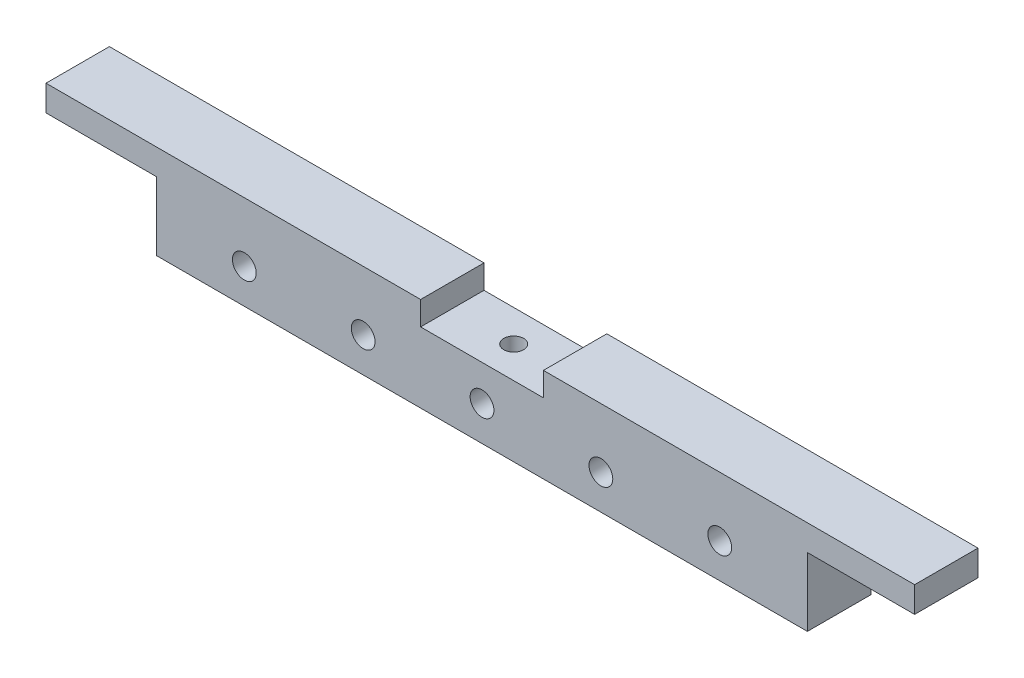
ISO-10303-21;
HEADER;
FILE_DESCRIPTION(('STEP AP214'),'2;1');
FILE_NAME('part.step','',(''),(''),'','','');
FILE_SCHEMA(('AUTOMOTIVE_DESIGN { 1 0 10303 214 1 1 1 1 }'));
ENDSEC;
DATA;
#1=APPLICATION_CONTEXT('core data for automotive mechanical design processes');
#2=APPLICATION_PROTOCOL_DEFINITION('international standard','automotive_design',2000,#1);
#3=PRODUCT_CONTEXT('',#1,'mechanical');
#4=PRODUCT('Part','Part','',(#3));
#5=PRODUCT_RELATED_PRODUCT_CATEGORY('part','',(#4));
#6=PRODUCT_DEFINITION_FORMATION('','',#4);
#7=PRODUCT_DEFINITION_CONTEXT('part definition',#1,'design');
#8=PRODUCT_DEFINITION('design','',#6,#7);
#9=PRODUCT_DEFINITION_SHAPE('','',#8);
#10=(LENGTH_UNIT() NAMED_UNIT(*) SI_UNIT(.MILLI.,.METRE.));
#11=(NAMED_UNIT(*) PLANE_ANGLE_UNIT() SI_UNIT($,.RADIAN.));
#12=(NAMED_UNIT(*) SI_UNIT($,.STERADIAN.) SOLID_ANGLE_UNIT());
#13=UNCERTAINTY_MEASURE_WITH_UNIT(LENGTH_MEASURE(1.E-05),#10,'distance_accuracy_value','');
#14=(GEOMETRIC_REPRESENTATION_CONTEXT(3) GLOBAL_UNCERTAINTY_ASSIGNED_CONTEXT((#13)) GLOBAL_UNIT_ASSIGNED_CONTEXT((#10,
#11,#12)) REPRESENTATION_CONTEXT('',''));
#15=CARTESIAN_POINT('',(0.,0.,0.));
#16=DIRECTION('',(0.,0.,1.));
#17=DIRECTION('',(1.,0.,0.));
#18=AXIS2_PLACEMENT_3D('',#15,#16,#17);
#19=CARTESIAN_POINT('',(0.,0.,32.));
#20=DIRECTION('',(0.,0.,-1.));
#21=DIRECTION('',(-1.,0.,0.));
#22=AXIS2_PLACEMENT_3D('',#19,#20,#21);
#23=PLANE('',#22);
#24=CARTESIAN_POINT('',(-37.5347965738758,-30.,32.));
#25=DIRECTION('',(0.,0.,1.));
#26=DIRECTION('',(1.,0.,0.));
#27=AXIS2_PLACEMENT_3D('',#24,#25,#26);
#28=CIRCLE('',#27,6.);
#29=CARTESIAN_POINT('',(-31.5347965738758,-30.,32.));
#30=VERTEX_POINT('',#29);
#31=EDGE_CURVE('E307',#30,#30,#28,.T.);
#32=ORIENTED_EDGE('',*,*,#31,.F.);
#33=EDGE_LOOP('',(#32));
#34=FACE_BOUND('',#33,.T.);
#35=CARTESIAN_POINT('',(82.4652034261242,-30.,32.));
#36=DIRECTION('',(0.,0.,1.));
#37=DIRECTION('',(1.,0.,0.));
#38=AXIS2_PLACEMENT_3D('',#35,#36,#37);
#39=CIRCLE('',#38,6.);
#40=CARTESIAN_POINT('',(88.4652034261242,-30.,32.));
#41=VERTEX_POINT('',#40);
#42=EDGE_CURVE('E319',#41,#41,#39,.T.);
#43=ORIENTED_EDGE('',*,*,#42,.F.);
#44=EDGE_LOOP('',(#43));
#45=FACE_BOUND('',#44,.T.);
#46=DIRECTION('',(0.,-1.,0.));
#47=VECTOR('',#46,1.);
#48=CARTESIAN_POINT('',(-197.653640256959,-13.,32.));
#49=LINE('',#48,#47);
#50=CARTESIAN_POINT('',(-197.653640256959,0.,32.));
#51=VERTEX_POINT('',#50);
#52=CARTESIAN_POINT('',(-197.653640256959,-13.,32.));
#53=VERTEX_POINT('',#52);
#54=EDGE_CURVE('E177',#51,#53,#49,.T.);
#55=ORIENTED_EDGE('',*,*,#54,.T.);
#56=DIRECTION('',(1.,0.,0.));
#57=VECTOR('',#56,1.);
#58=CARTESIAN_POINT('',(-141.784796573876,-13.,32.));
#59=LINE('',#58,#57);
#60=CARTESIAN_POINT('',(-141.784796573876,-13.,32.));
#61=VERTEX_POINT('',#60);
#62=EDGE_CURVE('E105',#53,#61,#59,.T.);
#63=ORIENTED_EDGE('',*,*,#62,.T.);
#64=DIRECTION('',(0.,-1.,0.));
#65=VECTOR('',#64,1.);
#66=CARTESIAN_POINT('',(-141.784796573876,-47.5,32.));
#67=LINE('',#66,#65);
#68=CARTESIAN_POINT('',(-141.784796573876,-47.5,32.));
#69=VERTEX_POINT('',#68);
#70=EDGE_CURVE('E204',#61,#69,#67,.T.);
#71=ORIENTED_EDGE('',*,*,#70,.T.);
#72=DIRECTION('',(1.,0.,0.));
#73=VECTOR('',#72,1.);
#74=CARTESIAN_POINT('',(186.715203426124,-47.5,32.));
#75=LINE('',#74,#73);
#76=CARTESIAN_POINT('',(186.715203426124,-47.5,32.));
#77=VERTEX_POINT('',#76);
#78=EDGE_CURVE('E223',#69,#77,#75,.T.);
#79=ORIENTED_EDGE('',*,*,#78,.T.);
#80=DIRECTION('',(0.,1.,0.));
#81=VECTOR('',#80,1.);
#82=CARTESIAN_POINT('',(186.715203426124,-12.9999999999999,32.));
#83=LINE('',#82,#81);
#84=CARTESIAN_POINT('',(186.715203426124,-12.9999999999999,32.));
#85=VERTEX_POINT('',#84);
#86=EDGE_CURVE('E220',#77,#85,#83,.T.);
#87=ORIENTED_EDGE('',*,*,#86,.T.);
#88=DIRECTION('',(1.,0.,0.));
#89=VECTOR('',#88,1.);
#90=CARTESIAN_POINT('',(186.715203426124,-12.9999999999999,32.));
#91=LINE('',#90,#89);
#92=CARTESIAN_POINT('',(240.846359743041,-12.9999999999999,32.));
#93=VERTEX_POINT('',#92);
#94=EDGE_CURVE('E222',#85,#93,#91,.T.);
#95=ORIENTED_EDGE('',*,*,#94,.T.);
#96=DIRECTION('',(0.,1.,0.));
#97=VECTOR('',#96,1.);
#98=CARTESIAN_POINT('',(240.846359743041,0.,32.));
#99=LINE('',#98,#97);
#100=CARTESIAN_POINT('',(240.846359743041,0.,32.));
#101=VERTEX_POINT('',#100);
#102=EDGE_CURVE('E225',#93,#101,#99,.T.);
#103=ORIENTED_EDGE('',*,*,#102,.T.);
#104=DIRECTION('',(-1.,0.,0.));
#105=VECTOR('',#104,1.);
#106=CARTESIAN_POINT('',(53.4652034261242,0.,32.));
#107=LINE('',#106,#105);
#108=CARTESIAN_POINT('',(53.4652034261242,0.,32.));
#109=VERTEX_POINT('',#108);
#110=EDGE_CURVE('E231',#101,#109,#107,.T.);
#111=ORIENTED_EDGE('',*,*,#110,.T.);
#112=DIRECTION('',(0.,-1.,0.));
#113=VECTOR('',#112,1.);
#114=CARTESIAN_POINT('',(53.4652034261242,-12.,32.));
#115=LINE('',#114,#113);
#116=CARTESIAN_POINT('',(53.4652034261242,-12.,32.));
#117=VERTEX_POINT('',#116);
#118=EDGE_CURVE('E136',#109,#117,#115,.T.);
#119=ORIENTED_EDGE('',*,*,#118,.T.);
#120=DIRECTION('',(-1.,0.,0.));
#121=VECTOR('',#120,1.);
#122=CARTESIAN_POINT('',(-8.53479657387579,-12.,32.));
#123=LINE('',#122,#121);
#124=CARTESIAN_POINT('',(-8.53479657387579,-12.,32.));
#125=VERTEX_POINT('',#124);
#126=EDGE_CURVE('E130',#117,#125,#123,.T.);
#127=ORIENTED_EDGE('',*,*,#126,.T.);
#128=DIRECTION('',(0.,1.,0.));
#129=VECTOR('',#128,1.);
#130=CARTESIAN_POINT('',(-8.53479657387579,0.,32.));
#131=LINE('',#130,#129);
#132=CARTESIAN_POINT('',(-8.53479657387579,0.,32.));
#133=VERTEX_POINT('',#132);
#134=EDGE_CURVE('E134',#125,#133,#131,.T.);
#135=ORIENTED_EDGE('',*,*,#134,.T.);
#136=DIRECTION('',(-1.,0.,0.));
#137=VECTOR('',#136,1.);
#138=CARTESIAN_POINT('',(-197.653640256959,0.,32.));
#139=LINE('',#138,#137);
#140=EDGE_CURVE('E50',#133,#51,#139,.T.);
#141=ORIENTED_EDGE('',*,*,#140,.T.);
#142=EDGE_LOOP('',(#55,#63,#71,#79,#87,#95,#103,#111,#119,#127,#135,#141));
#143=FACE_BOUND('',#142,.T.);
#144=CARTESIAN_POINT('',(22.4652034261242,-30.,32.));
#145=DIRECTION('',(0.,0.,1.));
#146=DIRECTION('',(1.,0.,0.));
#147=AXIS2_PLACEMENT_3D('',#144,#145,#146);
#148=CIRCLE('',#147,6.);
#149=CARTESIAN_POINT('',(28.4652034261242,-30.,32.));
#150=VERTEX_POINT('',#149);
#151=EDGE_CURVE('E158',#150,#150,#148,.T.);
#152=ORIENTED_EDGE('',*,*,#151,.F.);
#153=EDGE_LOOP('',(#152));
#154=FACE_BOUND('',#153,.T.);
#155=CARTESIAN_POINT('',(142.465203426124,-30.,32.));
#156=DIRECTION('',(0.,0.,1.));
#157=DIRECTION('',(1.,0.,0.));
#158=AXIS2_PLACEMENT_3D('',#155,#156,#157);
#159=CIRCLE('',#158,6.00000000000002);
#160=CARTESIAN_POINT('',(148.465203426124,-30.,32.));
#161=VERTEX_POINT('',#160);
#162=EDGE_CURVE('E313',#161,#161,#159,.T.);
#163=ORIENTED_EDGE('',*,*,#162,.F.);
#164=EDGE_LOOP('',(#163));
#165=FACE_BOUND('',#164,.T.);
#166=CARTESIAN_POINT('',(-97.5347965738758,-30.,32.));
#167=DIRECTION('',(0.,0.,1.));
#168=DIRECTION('',(1.,0.,0.));
#169=AXIS2_PLACEMENT_3D('',#166,#167,#168);
#170=CIRCLE('',#169,6.);
#171=CARTESIAN_POINT('',(-91.5347965738758,-30.,32.));
#172=VERTEX_POINT('',#171);
#173=EDGE_CURVE('E299',#172,#172,#170,.T.);
#174=ORIENTED_EDGE('',*,*,#173,.F.);
#175=EDGE_LOOP('',(#174));
#176=FACE_BOUND('',#175,.T.);
#177=ADVANCED_FACE('F33',(#34,#45,#143,#154,#165,#176),#23,.F.);
#178=CARTESIAN_POINT('',(0.,0.,0.));
#179=DIRECTION('',(0.,0.,-1.));
#180=DIRECTION('',(-1.,0.,0.));
#181=AXIS2_PLACEMENT_3D('',#178,#179,#180);
#182=PLANE('',#181);
#183=CARTESIAN_POINT('',(-37.5347965738758,-30.,0.));
#184=DIRECTION('',(0.,0.,1.));
#185=DIRECTION('',(1.,0.,0.));
#186=AXIS2_PLACEMENT_3D('',#183,#184,#185);
#187=CIRCLE('',#186,6.);
#188=CARTESIAN_POINT('',(-31.5347965738758,-30.,0.));
#189=VERTEX_POINT('',#188);
#190=EDGE_CURVE('E305',#189,#189,#187,.T.);
#191=ORIENTED_EDGE('',*,*,#190,.T.);
#192=EDGE_LOOP('',(#191));
#193=FACE_BOUND('',#192,.T.);
#194=CARTESIAN_POINT('',(82.4652034261242,-30.,0.));
#195=DIRECTION('',(0.,0.,1.));
#196=DIRECTION('',(1.,0.,0.));
#197=AXIS2_PLACEMENT_3D('',#194,#195,#196);
#198=CIRCLE('',#197,6.);
#199=CARTESIAN_POINT('',(88.4652034261242,-30.,0.));
#200=VERTEX_POINT('',#199);
#201=EDGE_CURVE('E316',#200,#200,#198,.T.);
#202=ORIENTED_EDGE('',*,*,#201,.T.);
#203=EDGE_LOOP('',(#202));
#204=FACE_BOUND('',#203,.T.);
#205=DIRECTION('',(0.,-1.,0.));
#206=VECTOR('',#205,1.);
#207=CARTESIAN_POINT('',(-197.653640256959,-13.,0.));
#208=LINE('',#207,#206);
#209=CARTESIAN_POINT('',(-197.653640256959,0.,0.));
#210=VERTEX_POINT('',#209);
#211=CARTESIAN_POINT('',(-197.653640256959,-13.,0.));
#212=VERTEX_POINT('',#211);
#213=EDGE_CURVE('E154',#210,#212,#208,.T.);
#214=ORIENTED_EDGE('',*,*,#213,.F.);
#215=DIRECTION('',(-1.,0.,0.));
#216=VECTOR('',#215,1.);
#217=CARTESIAN_POINT('',(-197.653640256959,0.,0.));
#218=LINE('',#217,#216);
#219=CARTESIAN_POINT('',(-8.53479657387579,0.,0.));
#220=VERTEX_POINT('',#219);
#221=EDGE_CURVE('E97',#220,#210,#218,.T.);
#222=ORIENTED_EDGE('',*,*,#221,.F.);
#223=DIRECTION('',(0.,1.,0.));
#224=VECTOR('',#223,1.);
#225=CARTESIAN_POINT('',(-8.53479657387579,0.,0.));
#226=LINE('',#225,#224);
#227=CARTESIAN_POINT('',(-8.53479657387579,-12.,0.));
#228=VERTEX_POINT('',#227);
#229=EDGE_CURVE('E91',#228,#220,#226,.T.);
#230=ORIENTED_EDGE('',*,*,#229,.F.);
#231=DIRECTION('',(-1.,0.,0.));
#232=VECTOR('',#231,1.);
#233=CARTESIAN_POINT('',(-8.53479657387579,-12.,0.));
#234=LINE('',#233,#232);
#235=CARTESIAN_POINT('',(53.4652034261242,-12.,0.));
#236=VERTEX_POINT('',#235);
#237=EDGE_CURVE('E144',#236,#228,#234,.T.);
#238=ORIENTED_EDGE('',*,*,#237,.F.);
#239=DIRECTION('',(0.,-1.,0.));
#240=VECTOR('',#239,1.);
#241=CARTESIAN_POINT('',(53.4652034261242,-12.,0.));
#242=LINE('',#241,#240);
#243=CARTESIAN_POINT('',(53.4652034261242,0.,0.));
#244=VERTEX_POINT('',#243);
#245=EDGE_CURVE('E172',#244,#236,#242,.T.);
#246=ORIENTED_EDGE('',*,*,#245,.F.);
#247=DIRECTION('',(-1.,0.,0.));
#248=VECTOR('',#247,1.);
#249=CARTESIAN_POINT('',(53.4652034261242,0.,0.));
#250=LINE('',#249,#248);
#251=CARTESIAN_POINT('',(240.846359743041,0.,0.));
#252=VERTEX_POINT('',#251);
#253=EDGE_CURVE('E170',#252,#244,#250,.T.);
#254=ORIENTED_EDGE('',*,*,#253,.F.);
#255=DIRECTION('',(0.,1.,0.));
#256=VECTOR('',#255,1.);
#257=CARTESIAN_POINT('',(240.846359743041,0.,0.));
#258=LINE('',#257,#256);
#259=CARTESIAN_POINT('',(240.846359743041,-12.9999999999999,0.));
#260=VERTEX_POINT('',#259);
#261=EDGE_CURVE('E168',#260,#252,#258,.T.);
#262=ORIENTED_EDGE('',*,*,#261,.F.);
#263=DIRECTION('',(1.,0.,0.));
#264=VECTOR('',#263,1.);
#265=CARTESIAN_POINT('',(186.715203426124,-12.9999999999999,0.));
#266=LINE('',#265,#264);
#267=CARTESIAN_POINT('',(186.715203426124,-12.9999999999999,0.));
#268=VERTEX_POINT('',#267);
#269=EDGE_CURVE('E166',#268,#260,#266,.T.);
#270=ORIENTED_EDGE('',*,*,#269,.F.);
#271=DIRECTION('',(0.,1.,0.));
#272=VECTOR('',#271,1.);
#273=CARTESIAN_POINT('',(186.715203426124,-12.9999999999999,0.));
#274=LINE('',#273,#272);
#275=CARTESIAN_POINT('',(186.715203426124,-47.5,0.));
#276=VERTEX_POINT('',#275);
#277=EDGE_CURVE('E164',#276,#268,#274,.T.);
#278=ORIENTED_EDGE('',*,*,#277,.F.);
#279=DIRECTION('',(1.,0.,0.));
#280=VECTOR('',#279,1.);
#281=CARTESIAN_POINT('',(186.715203426124,-47.5,0.));
#282=LINE('',#281,#280);
#283=CARTESIAN_POINT('',(-141.784796573876,-47.5,0.));
#284=VERTEX_POINT('',#283);
#285=EDGE_CURVE('E162',#284,#276,#282,.T.);
#286=ORIENTED_EDGE('',*,*,#285,.F.);
#287=DIRECTION('',(0.,-1.,0.));
#288=VECTOR('',#287,1.);
#289=CARTESIAN_POINT('',(-141.784796573876,-47.5,0.));
#290=LINE('',#289,#288);
#291=CARTESIAN_POINT('',(-141.784796573876,-13.,0.));
#292=VERTEX_POINT('',#291);
#293=EDGE_CURVE('E160',#292,#284,#290,.T.);
#294=ORIENTED_EDGE('',*,*,#293,.F.);
#295=DIRECTION('',(1.,0.,0.));
#296=VECTOR('',#295,1.);
#297=CARTESIAN_POINT('',(-141.784796573876,-13.,0.));
#298=LINE('',#297,#296);
#299=EDGE_CURVE('E157',#212,#292,#298,.T.);
#300=ORIENTED_EDGE('',*,*,#299,.F.);
#301=EDGE_LOOP('',(#214,#222,#230,#238,#246,#254,#262,#270,#278,#286,#294,#300));
#302=FACE_BOUND('',#301,.T.);
#303=CARTESIAN_POINT('',(22.4652034261242,-30.,0.));
#304=DIRECTION('',(0.,0.,1.));
#305=DIRECTION('',(1.,0.,0.));
#306=AXIS2_PLACEMENT_3D('',#303,#304,#305);
#307=CIRCLE('',#306,6.);
#308=CARTESIAN_POINT('',(28.4652034261242,-30.,0.));
#309=VERTEX_POINT('',#308);
#310=EDGE_CURVE('E322',#309,#309,#307,.T.);
#311=ORIENTED_EDGE('',*,*,#310,.T.);
#312=EDGE_LOOP('',(#311));
#313=FACE_BOUND('',#312,.T.);
#314=CARTESIAN_POINT('',(142.465203426124,-30.,0.));
#315=DIRECTION('',(0.,0.,1.));
#316=DIRECTION('',(1.,0.,0.));
#317=AXIS2_PLACEMENT_3D('',#314,#315,#316);
#318=CIRCLE('',#317,6.00000000000002);
#319=CARTESIAN_POINT('',(148.465203426124,-30.,0.));
#320=VERTEX_POINT('',#319);
#321=EDGE_CURVE('E310',#320,#320,#318,.T.);
#322=ORIENTED_EDGE('',*,*,#321,.T.);
#323=EDGE_LOOP('',(#322));
#324=FACE_BOUND('',#323,.T.);
#325=CARTESIAN_POINT('',(-97.5347965738758,-30.,0.));
#326=DIRECTION('',(0.,0.,1.));
#327=DIRECTION('',(1.,0.,0.));
#328=AXIS2_PLACEMENT_3D('',#325,#326,#327);
#329=CIRCLE('',#328,6.);
#330=CARTESIAN_POINT('',(-91.5347965738758,-30.,0.));
#331=VERTEX_POINT('',#330);
#332=EDGE_CURVE('E295',#331,#331,#329,.T.);
#333=ORIENTED_EDGE('',*,*,#332,.T.);
#334=EDGE_LOOP('',(#333));
#335=FACE_BOUND('',#334,.T.);
#336=ADVANCED_FACE('F208',(#193,#204,#302,#313,#324,#335),#182,.T.);
#337=CARTESIAN_POINT('',(-197.653640256959,-13.,32.));
#338=DIRECTION('',(1.,0.,0.));
#339=DIRECTION('',(0.,0.,-1.));
#340=AXIS2_PLACEMENT_3D('',#337,#338,#339);
#341=PLANE('',#340);
#342=ORIENTED_EDGE('',*,*,#213,.T.);
#343=DIRECTION('',(0.,0.,-1.));
#344=VECTOR('',#343,1.);
#345=CARTESIAN_POINT('',(-197.653640256959,-13.,32.));
#346=LINE('',#345,#344);
#347=EDGE_CURVE('E11',#53,#212,#346,.T.);
#348=ORIENTED_EDGE('',*,*,#347,.F.);
#349=ORIENTED_EDGE('',*,*,#54,.F.);
#350=DIRECTION('',(0.,0.,-1.));
#351=VECTOR('',#350,1.);
#352=CARTESIAN_POINT('',(-197.653640256959,0.,32.));
#353=LINE('',#352,#351);
#354=EDGE_CURVE('E150',#51,#210,#353,.T.);
#355=ORIENTED_EDGE('',*,*,#354,.T.);
#356=EDGE_LOOP('',(#342,#348,#349,#355));
#357=FACE_BOUND('',#356,.T.);
#358=ADVANCED_FACE('F35',(#357),#341,.F.);
#359=CARTESIAN_POINT('',(-141.784796573876,-13.,32.));
#360=DIRECTION('',(0.,1.,0.));
#361=DIRECTION('',(-1.,0.,0.));
#362=AXIS2_PLACEMENT_3D('',#359,#360,#361);
#363=PLANE('',#362);
#364=ORIENTED_EDGE('',*,*,#299,.T.);
#365=DIRECTION('',(0.,0.,-1.));
#366=VECTOR('',#365,1.);
#367=CARTESIAN_POINT('',(-141.784796573876,-13.,32.));
#368=LINE('',#367,#366);
#369=EDGE_CURVE('E42',#61,#292,#368,.T.);
#370=ORIENTED_EDGE('',*,*,#369,.F.);
#371=ORIENTED_EDGE('',*,*,#62,.F.);
#372=ORIENTED_EDGE('',*,*,#347,.T.);
#373=EDGE_LOOP('',(#364,#370,#371,#372));
#374=FACE_BOUND('',#373,.T.);
#375=ADVANCED_FACE('F374',(#374),#363,.F.);
#376=CARTESIAN_POINT('',(-141.784796573876,-47.5,32.));
#377=DIRECTION('',(1.,0.,0.));
#378=DIRECTION('',(0.,0.,-1.));
#379=AXIS2_PLACEMENT_3D('',#376,#377,#378);
#380=PLANE('',#379);
#381=ORIENTED_EDGE('',*,*,#293,.T.);
#382=DIRECTION('',(0.,0.,-1.));
#383=VECTOR('',#382,1.);
#384=CARTESIAN_POINT('',(-141.784796573876,-47.5,32.));
#385=LINE('',#384,#383);
#386=EDGE_CURVE('E196',#69,#284,#385,.T.);
#387=ORIENTED_EDGE('',*,*,#386,.F.);
#388=ORIENTED_EDGE('',*,*,#70,.F.);
#389=ORIENTED_EDGE('',*,*,#369,.T.);
#390=EDGE_LOOP('',(#381,#387,#388,#389));
#391=FACE_BOUND('',#390,.T.);
#392=ADVANCED_FACE('F202',(#391),#380,.F.);
#393=CARTESIAN_POINT('',(186.715203426124,-47.5,32.));
#394=DIRECTION('',(0.,1.,0.));
#395=DIRECTION('',(-1.,0.,0.));
#396=AXIS2_PLACEMENT_3D('',#393,#394,#395);
#397=PLANE('',#396);
#398=ORIENTED_EDGE('',*,*,#285,.T.);
#399=DIRECTION('',(0.,0.,-1.));
#400=VECTOR('',#399,1.);
#401=CARTESIAN_POINT('',(186.715203426124,-47.5,32.));
#402=LINE('',#401,#400);
#403=EDGE_CURVE('E193',#77,#276,#402,.T.);
#404=ORIENTED_EDGE('',*,*,#403,.F.);
#405=ORIENTED_EDGE('',*,*,#78,.F.);
#406=ORIENTED_EDGE('',*,*,#386,.T.);
#407=EDGE_LOOP('',(#398,#404,#405,#406));
#408=FACE_BOUND('',#407,.T.);
#409=ADVANCED_FACE('F214',(#408),#397,.F.);
#410=CARTESIAN_POINT('',(186.715203426124,-12.9999999999999,32.));
#411=DIRECTION('',(-1.,0.,0.));
#412=DIRECTION('',(0.,0.,1.));
#413=AXIS2_PLACEMENT_3D('',#410,#411,#412);
#414=PLANE('',#413);
#415=ORIENTED_EDGE('',*,*,#277,.T.);
#416=DIRECTION('',(0.,0.,-1.));
#417=VECTOR('',#416,1.);
#418=CARTESIAN_POINT('',(186.715203426124,-12.9999999999999,32.));
#419=LINE('',#418,#417);
#420=EDGE_CURVE('E190',#85,#268,#419,.T.);
#421=ORIENTED_EDGE('',*,*,#420,.F.);
#422=ORIENTED_EDGE('',*,*,#86,.F.);
#423=ORIENTED_EDGE('',*,*,#403,.T.);
#424=EDGE_LOOP('',(#415,#421,#422,#423));
#425=FACE_BOUND('',#424,.T.);
#426=ADVANCED_FACE('F218',(#425),#414,.F.);
#427=CARTESIAN_POINT('',(186.715203426124,-12.9999999999999,32.));
#428=DIRECTION('',(0.,1.,0.));
#429=DIRECTION('',(-1.,0.,0.));
#430=AXIS2_PLACEMENT_3D('',#427,#428,#429);
#431=PLANE('',#430);
#432=ORIENTED_EDGE('',*,*,#269,.T.);
#433=DIRECTION('',(0.,0.,-1.));
#434=VECTOR('',#433,1.);
#435=CARTESIAN_POINT('',(240.846359743041,-12.9999999999999,32.));
#436=LINE('',#435,#434);
#437=EDGE_CURVE('E187',#93,#260,#436,.T.);
#438=ORIENTED_EDGE('',*,*,#437,.F.);
#439=ORIENTED_EDGE('',*,*,#94,.F.);
#440=ORIENTED_EDGE('',*,*,#420,.T.);
#441=EDGE_LOOP('',(#432,#438,#439,#440));
#442=FACE_BOUND('',#441,.T.);
#443=ADVANCED_FACE('F364',(#442),#431,.F.);
#444=CARTESIAN_POINT('',(240.846359743041,0.,32.));
#445=DIRECTION('',(-1.,0.,0.));
#446=DIRECTION('',(0.,-1.,0.));
#447=AXIS2_PLACEMENT_3D('',#444,#445,#446);
#448=PLANE('',#447);
#449=ORIENTED_EDGE('',*,*,#261,.T.);
#450=DIRECTION('',(0.,0.,-1.));
#451=VECTOR('',#450,1.);
#452=CARTESIAN_POINT('',(240.846359743041,0.,32.));
#453=LINE('',#452,#451);
#454=EDGE_CURVE('E184',#101,#252,#453,.T.);
#455=ORIENTED_EDGE('',*,*,#454,.F.);
#456=ORIENTED_EDGE('',*,*,#102,.F.);
#457=ORIENTED_EDGE('',*,*,#437,.T.);
#458=EDGE_LOOP('',(#449,#455,#456,#457));
#459=FACE_BOUND('',#458,.T.);
#460=ADVANCED_FACE('F361',(#459),#448,.F.);
#461=CARTESIAN_POINT('',(53.4652034261242,0.,32.));
#462=DIRECTION('',(0.,-1.,0.));
#463=DIRECTION('',(0.,0.,-1.));
#464=AXIS2_PLACEMENT_3D('',#461,#462,#463);
#465=PLANE('',#464);
#466=ORIENTED_EDGE('',*,*,#253,.T.);
#467=DIRECTION('',(0.,0.,-1.));
#468=VECTOR('',#467,1.);
#469=CARTESIAN_POINT('',(53.4652034261242,0.,32.));
#470=LINE('',#469,#468);
#471=EDGE_CURVE('E181',#109,#244,#470,.T.);
#472=ORIENTED_EDGE('',*,*,#471,.F.);
#473=ORIENTED_EDGE('',*,*,#110,.F.);
#474=ORIENTED_EDGE('',*,*,#454,.T.);
#475=EDGE_LOOP('',(#466,#472,#473,#474));
#476=FACE_BOUND('',#475,.T.);
#477=ADVANCED_FACE('F237',(#476),#465,.F.);
#478=CARTESIAN_POINT('',(53.4652034261242,-12.,32.));
#479=DIRECTION('',(1.,0.,0.));
#480=DIRECTION('',(0.,0.,-1.));
#481=AXIS2_PLACEMENT_3D('',#478,#479,#480);
#482=PLANE('',#481);
#483=ORIENTED_EDGE('',*,*,#245,.T.);
#484=DIRECTION('',(0.,0.,-1.));
#485=VECTOR('',#484,1.);
#486=CARTESIAN_POINT('',(53.4652034261242,-12.,32.));
#487=LINE('',#486,#485);
#488=EDGE_CURVE('E145',#117,#236,#487,.T.);
#489=ORIENTED_EDGE('',*,*,#488,.F.);
#490=ORIENTED_EDGE('',*,*,#118,.F.);
#491=ORIENTED_EDGE('',*,*,#471,.T.);
#492=EDGE_LOOP('',(#483,#489,#490,#491));
#493=FACE_BOUND('',#492,.T.);
#494=ADVANCED_FACE('F241',(#493),#482,.F.);
#495=CARTESIAN_POINT('',(-8.53479657387579,-12.,32.));
#496=DIRECTION('',(0.,-1.,0.));
#497=DIRECTION('',(0.,0.,-1.));
#498=AXIS2_PLACEMENT_3D('',#495,#496,#497);
#499=PLANE('',#498);
#500=CARTESIAN_POINT('',(22.4652034261242,-12.,16.));
#501=DIRECTION('',(0.,1.,0.));
#502=DIRECTION('',(0.,0.,1.));
#503=AXIS2_PLACEMENT_3D('',#500,#501,#502);
#504=CIRCLE('',#503,5.);
#505=CARTESIAN_POINT('',(22.4652034261242,-12.,21.));
#506=VERTEX_POINT('',#505);
#507=EDGE_CURVE('E296',#506,#506,#504,.T.);
#508=ORIENTED_EDGE('',*,*,#507,.F.);
#509=EDGE_LOOP('',(#508));
#510=FACE_BOUND('',#509,.T.);
#511=ORIENTED_EDGE('',*,*,#237,.T.);
#512=DIRECTION('',(0.,0.,-1.));
#513=VECTOR('',#512,1.);
#514=CARTESIAN_POINT('',(-8.53479657387579,-12.,32.));
#515=LINE('',#514,#513);
#516=EDGE_CURVE('E141',#125,#228,#515,.T.);
#517=ORIENTED_EDGE('',*,*,#516,.F.);
#518=ORIENTED_EDGE('',*,*,#126,.F.);
#519=ORIENTED_EDGE('',*,*,#488,.T.);
#520=EDGE_LOOP('',(#511,#517,#518,#519));
#521=FACE_BOUND('',#520,.T.);
#522=ADVANCED_FACE('F142',(#510,#521),#499,.F.);
#523=CARTESIAN_POINT('',(-8.53479657387579,0.,32.));
#524=DIRECTION('',(-1.,0.,0.));
#525=DIRECTION('',(0.,-1.,0.));
#526=AXIS2_PLACEMENT_3D('',#523,#524,#525);
#527=PLANE('',#526);
#528=ORIENTED_EDGE('',*,*,#229,.T.);
#529=DIRECTION('',(0.,0.,-1.));
#530=VECTOR('',#529,1.);
#531=CARTESIAN_POINT('',(-8.53479657387579,0.,32.));
#532=LINE('',#531,#530);
#533=EDGE_CURVE('E146',#133,#220,#532,.T.);
#534=ORIENTED_EDGE('',*,*,#533,.F.);
#535=ORIENTED_EDGE('',*,*,#134,.F.);
#536=ORIENTED_EDGE('',*,*,#516,.T.);
#537=EDGE_LOOP('',(#528,#534,#535,#536));
#538=FACE_BOUND('',#537,.T.);
#539=ADVANCED_FACE('F148',(#538),#527,.F.);
#540=CARTESIAN_POINT('',(-197.653640256959,0.,32.));
#541=DIRECTION('',(0.,-1.,0.));
#542=DIRECTION('',(1.,0.,0.));
#543=AXIS2_PLACEMENT_3D('',#540,#541,#542);
#544=PLANE('',#543);
#545=ORIENTED_EDGE('',*,*,#221,.T.);
#546=ORIENTED_EDGE('',*,*,#354,.F.);
#547=ORIENTED_EDGE('',*,*,#140,.F.);
#548=ORIENTED_EDGE('',*,*,#533,.T.);
#549=EDGE_LOOP('',(#545,#546,#547,#548));
#550=FACE_BOUND('',#549,.T.);
#551=ADVANCED_FACE('F245',(#550),#544,.F.);
#552=CARTESIAN_POINT('',(22.4652034261242,-30.,32.));
#553=DIRECTION('',(0.,0.,-1.));
#554=DIRECTION('',(-1.,0.,0.));
#555=AXIS2_PLACEMENT_3D('',#552,#553,#554);
#556=CYLINDRICAL_SURFACE('',#555,6.);
#557=ORIENTED_EDGE('',*,*,#151,.T.);
#558=EDGE_LOOP('',(#557));
#559=FACE_BOUND('',#558,.T.);
#560=ORIENTED_EDGE('',*,*,#310,.F.);
#561=EDGE_LOOP('',(#560));
#562=FACE_BOUND('',#561,.T.);
#563=ADVANCED_FACE('F247',(#559,#562),#556,.F.);
#564=CARTESIAN_POINT('',(82.4652034261242,-30.,32.));
#565=DIRECTION('',(0.,0.,-1.));
#566=DIRECTION('',(-1.,0.,0.));
#567=AXIS2_PLACEMENT_3D('',#564,#565,#566);
#568=CYLINDRICAL_SURFACE('',#567,6.);
#569=ORIENTED_EDGE('',*,*,#42,.T.);
#570=EDGE_LOOP('',(#569));
#571=FACE_BOUND('',#570,.T.);
#572=ORIENTED_EDGE('',*,*,#201,.F.);
#573=EDGE_LOOP('',(#572));
#574=FACE_BOUND('',#573,.T.);
#575=ADVANCED_FACE('F253',(#571,#574),#568,.F.);
#576=CARTESIAN_POINT('',(142.465203426124,-30.,32.));
#577=DIRECTION('',(0.,0.,-1.));
#578=DIRECTION('',(-1.,0.,0.));
#579=AXIS2_PLACEMENT_3D('',#576,#577,#578);
#580=CYLINDRICAL_SURFACE('',#579,6.00000000000002);
#581=ORIENTED_EDGE('',*,*,#162,.T.);
#582=EDGE_LOOP('',(#581));
#583=FACE_BOUND('',#582,.T.);
#584=ORIENTED_EDGE('',*,*,#321,.F.);
#585=EDGE_LOOP('',(#584));
#586=FACE_BOUND('',#585,.T.);
#587=ADVANCED_FACE('F270',(#583,#586),#580,.F.);
#588=CARTESIAN_POINT('',(-37.5347965738758,-30.,32.));
#589=DIRECTION('',(0.,0.,-1.));
#590=DIRECTION('',(-1.,0.,0.));
#591=AXIS2_PLACEMENT_3D('',#588,#589,#590);
#592=CYLINDRICAL_SURFACE('',#591,6.);
#593=ORIENTED_EDGE('',*,*,#31,.T.);
#594=EDGE_LOOP('',(#593));
#595=FACE_BOUND('',#594,.T.);
#596=ORIENTED_EDGE('',*,*,#190,.F.);
#597=EDGE_LOOP('',(#596));
#598=FACE_BOUND('',#597,.T.);
#599=ADVANCED_FACE('F274',(#595,#598),#592,.F.);
#600=CARTESIAN_POINT('',(-97.5347965738758,-30.,32.));
#601=DIRECTION('',(0.,0.,-1.));
#602=DIRECTION('',(-1.,0.,0.));
#603=AXIS2_PLACEMENT_3D('',#600,#601,#602);
#604=CYLINDRICAL_SURFACE('',#603,6.);
#605=ORIENTED_EDGE('',*,*,#173,.T.);
#606=EDGE_LOOP('',(#605));
#607=FACE_BOUND('',#606,.T.);
#608=ORIENTED_EDGE('',*,*,#332,.F.);
#609=EDGE_LOOP('',(#608));
#610=FACE_BOUND('',#609,.T.);
#611=ADVANCED_FACE('F278',(#607,#610),#604,.F.);
#612=CARTESIAN_POINT('',(22.4652034261242,-22.,16.));
#613=DIRECTION('',(0.,1.,0.));
#614=DIRECTION('',(0.,0.,1.));
#615=AXIS2_PLACEMENT_3D('',#612,#613,#614);
#616=CYLINDRICAL_SURFACE('',#615,5.);
#617=CARTESIAN_POINT('',(22.4652034261242,-22.,16.));
#618=DIRECTION('',(0.,1.,0.));
#619=DIRECTION('',(0.,0.,1.));
#620=AXIS2_PLACEMENT_3D('',#617,#618,#619);
#621=CIRCLE('',#620,5.);
#622=CARTESIAN_POINT('',(22.4652034261242,-22.,21.));
#623=VERTEX_POINT('',#622);
#624=EDGE_CURVE('E294',#623,#623,#621,.T.);
#625=ORIENTED_EDGE('',*,*,#624,.F.);
#626=EDGE_LOOP('',(#625));
#627=FACE_BOUND('',#626,.T.);
#628=ORIENTED_EDGE('',*,*,#507,.T.);
#629=EDGE_LOOP('',(#628));
#630=FACE_BOUND('',#629,.T.);
#631=ADVANCED_FACE('F282',(#627,#630),#616,.F.);
#632=CARTESIAN_POINT('',(22.4652034261242,-22.,16.));
#633=DIRECTION('',(0.,1.,0.));
#634=DIRECTION('',(0.,0.,1.));
#635=AXIS2_PLACEMENT_3D('',#632,#633,#634);
#636=PLANE('',#635);
#637=ORIENTED_EDGE('',*,*,#624,.T.);
#638=EDGE_LOOP('',(#637));
#639=FACE_BOUND('',#638,.T.);
#640=ADVANCED_FACE('F286',(#639),#636,.T.);
#641=CLOSED_SHELL('',(#177,#336,#358,#375,#392,#409,#426,#443,#460,#477,#494,#522,#539,#551,
#563,#575,#587,#599,#611,#631,#640));
#642=MANIFOLD_SOLID_BREP('B2',#641);
#643=ADVANCED_BREP_SHAPE_REPRESENTATION('',(#18,#642),#14);
#644=SHAPE_DEFINITION_REPRESENTATION(#9,#643);
ENDSEC;
END-ISO-10303-21;
